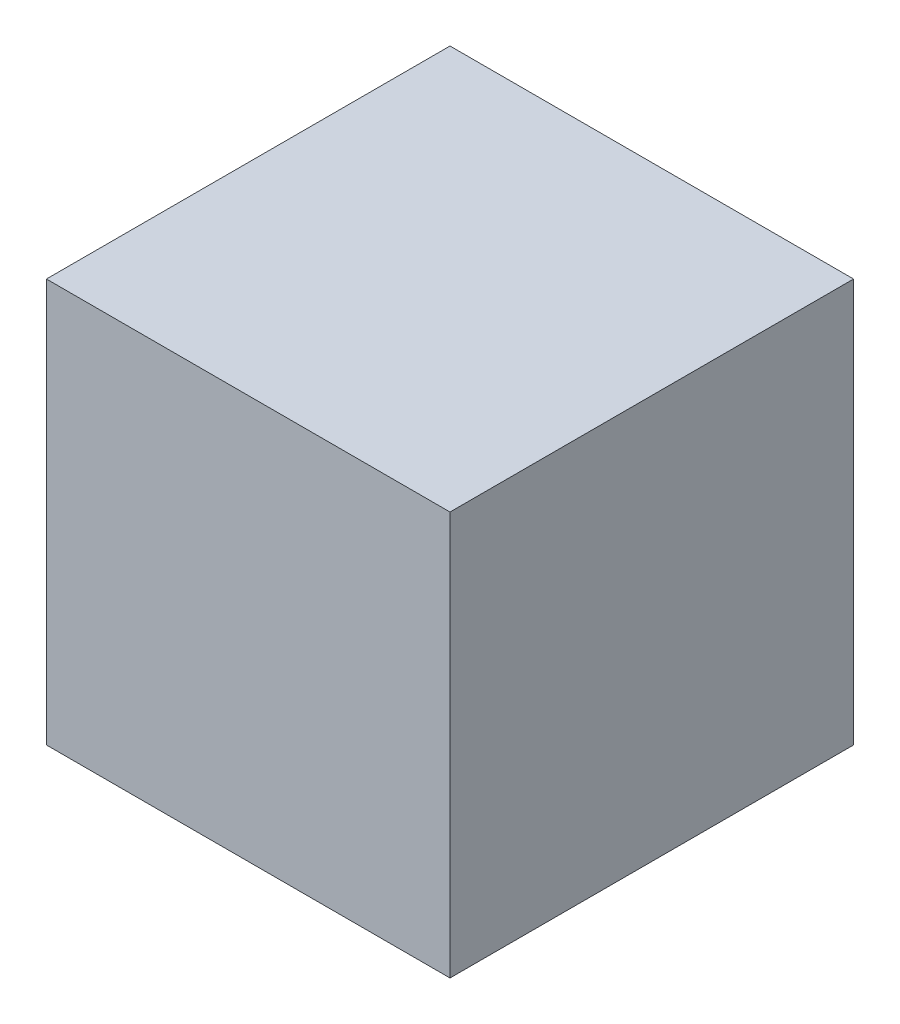
ISO-10303-21;
HEADER;
FILE_DESCRIPTION(('STEP AP214'),'2;1');
FILE_NAME('part.step','',(''),(''),'','','');
FILE_SCHEMA(('AUTOMOTIVE_DESIGN { 1 0 10303 214 1 1 1 1 }'));
ENDSEC;
DATA;
#1=APPLICATION_CONTEXT('core data for automotive mechanical design processes');
#2=APPLICATION_PROTOCOL_DEFINITION('international standard','automotive_design',2000,#1);
#3=PRODUCT_CONTEXT('',#1,'mechanical');
#4=PRODUCT('Part','Part','',(#3));
#5=PRODUCT_RELATED_PRODUCT_CATEGORY('part','',(#4));
#6=PRODUCT_DEFINITION_FORMATION('','',#4);
#7=PRODUCT_DEFINITION_CONTEXT('part definition',#1,'design');
#8=PRODUCT_DEFINITION('design','',#6,#7);
#9=PRODUCT_DEFINITION_SHAPE('','',#8);
#10=(LENGTH_UNIT() NAMED_UNIT(*) SI_UNIT(.MILLI.,.METRE.));
#11=(NAMED_UNIT(*) PLANE_ANGLE_UNIT() SI_UNIT($,.RADIAN.));
#12=(NAMED_UNIT(*) SI_UNIT($,.STERADIAN.) SOLID_ANGLE_UNIT());
#13=UNCERTAINTY_MEASURE_WITH_UNIT(LENGTH_MEASURE(1.E-05),#10,'distance_accuracy_value','');
#14=(GEOMETRIC_REPRESENTATION_CONTEXT(3) GLOBAL_UNCERTAINTY_ASSIGNED_CONTEXT((#13)) GLOBAL_UNIT_ASSIGNED_CONTEXT((#10,
#11,#12)) REPRESENTATION_CONTEXT('',''));
#15=CARTESIAN_POINT('',(0.,0.,0.));
#16=DIRECTION('',(0.,0.,1.));
#17=DIRECTION('',(1.,0.,0.));
#18=AXIS2_PLACEMENT_3D('',#15,#16,#17);
#19=CARTESIAN_POINT('',(-100.,100.,200.));
#20=DIRECTION('',(0.,1.,0.));
#21=DIRECTION('',(0.,0.,1.));
#22=AXIS2_PLACEMENT_3D('',#19,#20,#21);
#23=PLANE('',#22);
#24=DIRECTION('',(1.,0.,0.));
#25=VECTOR('',#24,1.);
#26=CARTESIAN_POINT('',(-100.,100.,0.));
#27=LINE('',#26,#25);
#28=CARTESIAN_POINT('',(-100.,100.,0.));
#29=VERTEX_POINT('',#28);
#30=CARTESIAN_POINT('',(100.,100.,0.));
#31=VERTEX_POINT('',#30);
#32=EDGE_CURVE('E98',#29,#31,#27,.T.);
#33=ORIENTED_EDGE('',*,*,#32,.F.);
#34=DIRECTION('',(0.,0.,-1.));
#35=VECTOR('',#34,1.);
#36=CARTESIAN_POINT('',(-100.,100.,200.));
#37=LINE('',#36,#35);
#38=CARTESIAN_POINT('',(-100.,100.,200.));
#39=VERTEX_POINT('',#38);
#40=EDGE_CURVE('E11',#39,#29,#37,.T.);
#41=ORIENTED_EDGE('',*,*,#40,.F.);
#42=DIRECTION('',(1.,0.,0.));
#43=VECTOR('',#42,1.);
#44=CARTESIAN_POINT('',(-100.,100.,200.));
#45=LINE('',#44,#43);
#46=CARTESIAN_POINT('',(100.,100.,200.));
#47=VERTEX_POINT('',#46);
#48=EDGE_CURVE('E93',#39,#47,#45,.T.);
#49=ORIENTED_EDGE('',*,*,#48,.T.);
#50=DIRECTION('',(0.,0.,-1.));
#51=VECTOR('',#50,1.);
#52=CARTESIAN_POINT('',(100.,100.,200.));
#53=LINE('',#52,#51);
#54=EDGE_CURVE('E36',#47,#31,#53,.T.);
#55=ORIENTED_EDGE('',*,*,#54,.T.);
#56=EDGE_LOOP('',(#33,#41,#49,#55));
#57=FACE_BOUND('',#56,.T.);
#58=ADVANCED_FACE('F33',(#57),#23,.T.);
#59=CARTESIAN_POINT('',(-100.,100.,200.));
#60=DIRECTION('',(1.,0.,0.));
#61=DIRECTION('',(0.,1.,0.));
#62=AXIS2_PLACEMENT_3D('',#59,#60,#61);
#63=PLANE('',#62);
#64=DIRECTION('',(0.,-1.,0.));
#65=VECTOR('',#64,1.);
#66=CARTESIAN_POINT('',(-100.,100.,0.));
#67=LINE('',#66,#65);
#68=CARTESIAN_POINT('',(-100.,-100.,0.));
#69=VERTEX_POINT('',#68);
#70=EDGE_CURVE('E66',#29,#69,#67,.T.);
#71=ORIENTED_EDGE('',*,*,#70,.T.);
#72=DIRECTION('',(0.,0.,-1.));
#73=VECTOR('',#72,1.);
#74=CARTESIAN_POINT('',(-100.,-100.,200.));
#75=LINE('',#74,#73);
#76=CARTESIAN_POINT('',(-100.,-100.,200.));
#77=VERTEX_POINT('',#76);
#78=EDGE_CURVE('E42',#77,#69,#75,.T.);
#79=ORIENTED_EDGE('',*,*,#78,.F.);
#80=DIRECTION('',(0.,-1.,0.));
#81=VECTOR('',#80,1.);
#82=CARTESIAN_POINT('',(-100.,100.,200.));
#83=LINE('',#82,#81);
#84=EDGE_CURVE('E83',#39,#77,#83,.T.);
#85=ORIENTED_EDGE('',*,*,#84,.F.);
#86=ORIENTED_EDGE('',*,*,#40,.T.);
#87=EDGE_LOOP('',(#71,#79,#85,#86));
#88=FACE_BOUND('',#87,.T.);
#89=ADVANCED_FACE('F108',(#88),#63,.F.);
#90=CARTESIAN_POINT('',(-100.,-100.,200.));
#91=DIRECTION('',(0.,1.,0.));
#92=DIRECTION('',(0.,0.,1.));
#93=AXIS2_PLACEMENT_3D('',#90,#91,#92);
#94=PLANE('',#93);
#95=DIRECTION('',(1.,0.,0.));
#96=VECTOR('',#95,1.);
#97=CARTESIAN_POINT('',(-100.,-100.,0.));
#98=LINE('',#97,#96);
#99=CARTESIAN_POINT('',(100.,-100.,0.));
#100=VERTEX_POINT('',#99);
#101=EDGE_CURVE('E90',#69,#100,#98,.T.);
#102=ORIENTED_EDGE('',*,*,#101,.T.);
#103=DIRECTION('',(0.,0.,-1.));
#104=VECTOR('',#103,1.);
#105=CARTESIAN_POINT('',(100.,-100.,200.));
#106=LINE('',#105,#104);
#107=CARTESIAN_POINT('',(100.,-100.,200.));
#108=VERTEX_POINT('',#107);
#109=EDGE_CURVE('E87',#108,#100,#106,.T.);
#110=ORIENTED_EDGE('',*,*,#109,.F.);
#111=DIRECTION('',(1.,0.,0.));
#112=VECTOR('',#111,1.);
#113=CARTESIAN_POINT('',(-100.,-100.,200.));
#114=LINE('',#113,#112);
#115=EDGE_CURVE('E78',#77,#108,#114,.T.);
#116=ORIENTED_EDGE('',*,*,#115,.F.);
#117=ORIENTED_EDGE('',*,*,#78,.T.);
#118=EDGE_LOOP('',(#102,#110,#116,#117));
#119=FACE_BOUND('',#118,.T.);
#120=ADVANCED_FACE('F88',(#119),#94,.F.);
#121=CARTESIAN_POINT('',(100.,100.,200.));
#122=DIRECTION('',(1.,0.,0.));
#123=DIRECTION('',(0.,1.,0.));
#124=AXIS2_PLACEMENT_3D('',#121,#122,#123);
#125=PLANE('',#124);
#126=DIRECTION('',(0.,-1.,0.));
#127=VECTOR('',#126,1.);
#128=CARTESIAN_POINT('',(100.,100.,0.));
#129=LINE('',#128,#127);
#130=EDGE_CURVE('E101',#31,#100,#129,.T.);
#131=ORIENTED_EDGE('',*,*,#130,.F.);
#132=ORIENTED_EDGE('',*,*,#54,.F.);
#133=DIRECTION('',(0.,-1.,0.));
#134=VECTOR('',#133,1.);
#135=CARTESIAN_POINT('',(100.,100.,200.));
#136=LINE('',#135,#134);
#137=EDGE_CURVE('E82',#47,#108,#136,.T.);
#138=ORIENTED_EDGE('',*,*,#137,.T.);
#139=ORIENTED_EDGE('',*,*,#109,.T.);
#140=EDGE_LOOP('',(#131,#132,#138,#139));
#141=FACE_BOUND('',#140,.T.);
#142=ADVANCED_FACE('F92',(#141),#125,.T.);
#143=CARTESIAN_POINT('',(0.,0.,200.));
#144=DIRECTION('',(0.,0.,-1.));
#145=DIRECTION('',(-1.,0.,0.));
#146=AXIS2_PLACEMENT_3D('',#143,#144,#145);
#147=PLANE('',#146);
#148=ORIENTED_EDGE('',*,*,#48,.F.);
#149=ORIENTED_EDGE('',*,*,#84,.T.);
#150=ORIENTED_EDGE('',*,*,#115,.T.);
#151=ORIENTED_EDGE('',*,*,#137,.F.);
#152=EDGE_LOOP('',(#148,#149,#150,#151));
#153=FACE_BOUND('',#152,.T.);
#154=ADVANCED_FACE('F81',(#153),#147,.F.);
#155=CARTESIAN_POINT('',(0.,0.,0.));
#156=DIRECTION('',(0.,0.,-1.));
#157=DIRECTION('',(-1.,0.,0.));
#158=AXIS2_PLACEMENT_3D('',#155,#156,#157);
#159=PLANE('',#158);
#160=ORIENTED_EDGE('',*,*,#32,.T.);
#161=ORIENTED_EDGE('',*,*,#130,.T.);
#162=ORIENTED_EDGE('',*,*,#101,.F.);
#163=ORIENTED_EDGE('',*,*,#70,.F.);
#164=EDGE_LOOP('',(#160,#161,#162,#163));
#165=FACE_BOUND('',#164,.T.);
#166=ADVANCED_FACE('F106',(#165),#159,.T.);
#167=CLOSED_SHELL('',(#58,#89,#120,#142,#154,#166));
#168=MANIFOLD_SOLID_BREP('B2',#167);
#169=ADVANCED_BREP_SHAPE_REPRESENTATION('',(#18,#168),#14);
#170=SHAPE_DEFINITION_REPRESENTATION(#9,#169);
ENDSEC;
END-ISO-10303-21;
